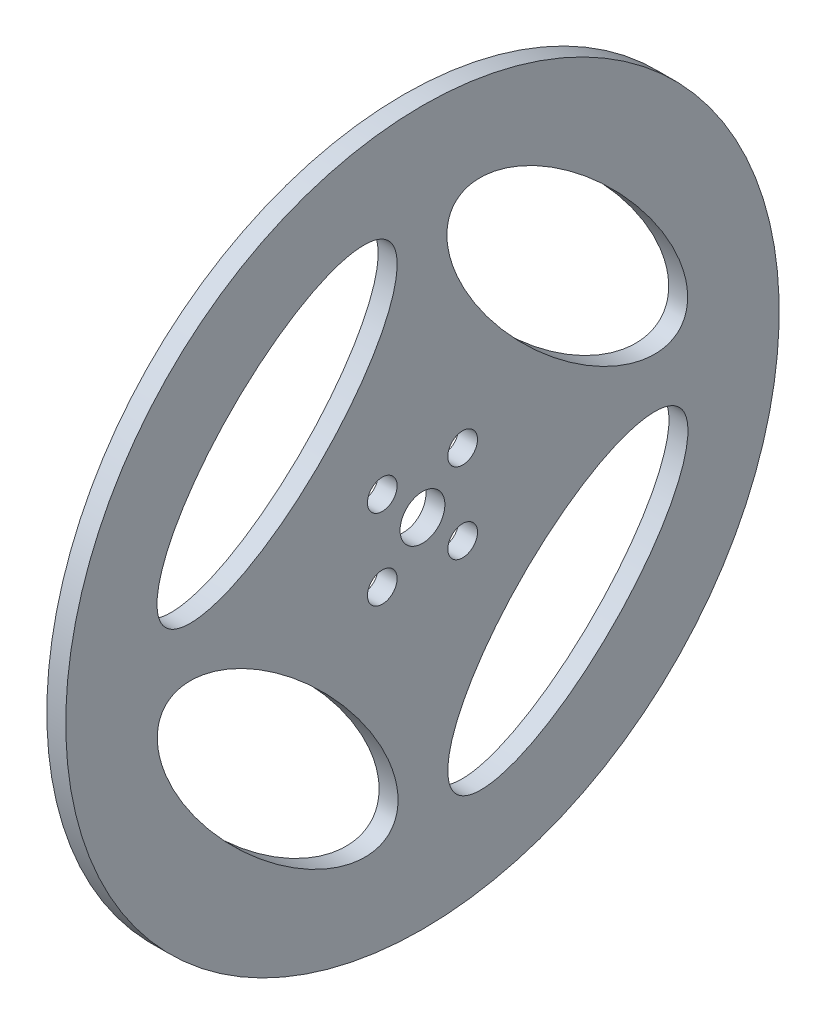
ISO-10303-21;
HEADER;
FILE_DESCRIPTION(('STEP AP214'),'2;1');
FILE_NAME('part.step','',(''),(''),'','','');
FILE_SCHEMA(('AUTOMOTIVE_DESIGN { 1 0 10303 214 1 1 1 1 }'));
ENDSEC;
DATA;
#1=APPLICATION_CONTEXT('core data for automotive mechanical design processes');
#2=APPLICATION_PROTOCOL_DEFINITION('international standard','automotive_design',2000,#1);
#3=PRODUCT_CONTEXT('',#1,'mechanical');
#4=PRODUCT('Part','Part','',(#3));
#5=PRODUCT_RELATED_PRODUCT_CATEGORY('part','',(#4));
#6=PRODUCT_DEFINITION_FORMATION('','',#4);
#7=PRODUCT_DEFINITION_CONTEXT('part definition',#1,'design');
#8=PRODUCT_DEFINITION('design','',#6,#7);
#9=PRODUCT_DEFINITION_SHAPE('','',#8);
#10=(LENGTH_UNIT() NAMED_UNIT(*) SI_UNIT(.MILLI.,.METRE.));
#11=(NAMED_UNIT(*) PLANE_ANGLE_UNIT() SI_UNIT($,.RADIAN.));
#12=(NAMED_UNIT(*) SI_UNIT($,.STERADIAN.) SOLID_ANGLE_UNIT());
#13=UNCERTAINTY_MEASURE_WITH_UNIT(LENGTH_MEASURE(1.E-05),#10,'distance_accuracy_value','');
#14=(GEOMETRIC_REPRESENTATION_CONTEXT(3) GLOBAL_UNCERTAINTY_ASSIGNED_CONTEXT((#13)) GLOBAL_UNIT_ASSIGNED_CONTEXT((#10,
#11,#12)) REPRESENTATION_CONTEXT('',''));
#15=CARTESIAN_POINT('',(0.,0.,0.));
#16=DIRECTION('',(0.,0.,1.));
#17=DIRECTION('',(1.,0.,0.));
#18=AXIS2_PLACEMENT_3D('',#15,#16,#17);
#19=CARTESIAN_POINT('',(-41.053372852788,13.3,0.));
#20=DIRECTION('',(-1.,0.,0.));
#21=DIRECTION('',(0.,-1.,0.));
#22=AXIS2_PLACEMENT_3D('',#19,#20,#21);
#23=PLANE('',#22);
#24=CARTESIAN_POINT('',(-41.053372852788,32.7773295973494,-22.9345155078859));
#25=DIRECTION('',(1.,0.,0.));
#26=DIRECTION('',(0.,-0.705987654506573,-0.708224139439138));
#27=AXIS2_PLACEMENT_3D('',#24,#25,#26);
#28=ELLIPSE('',#27,25.,10.);
#29=CARTESIAN_POINT('',(-41.053372852788,15.1276382346851,-40.6401189938644));
#30=VERTEX_POINT('',#29);
#31=EDGE_CURVE('E147',#30,#30,#28,.T.);
#32=ORIENTED_EDGE('',*,*,#31,.T.);
#33=EDGE_LOOP('',(#32));
#34=FACE_BOUND('',#33,.T.);
#35=CARTESIAN_POINT('',(-41.053372852788,-13.1845155078862,-23.0273295973492));
#36=DIRECTION('',(1.,0.,0.));
#37=DIRECTION('',(0.,-0.708224139439131,0.70598765450658));
#38=AXIS2_PLACEMENT_3D('',#35,#36,#37);
#39=ELLIPSE('',#38,25.,10.);
#40=CARTESIAN_POINT('',(-41.053372852788,-30.8901189938644,-5.37763823468465));
#41=VERTEX_POINT('',#40);
#42=EDGE_CURVE('E151',#41,#41,#39,.T.);
#43=ORIENTED_EDGE('',*,*,#42,.T.);
#44=EDGE_LOOP('',(#43));
#45=FACE_BOUND('',#44,.T.);
#46=CARTESIAN_POINT('',(-41.053372852788,-13.2773295973493,22.9345155078861));
#47=DIRECTION('',(1.,0.,0.));
#48=DIRECTION('',(0.,0.705987654506578,0.708224139439133));
#49=AXIS2_PLACEMENT_3D('',#46,#47,#48);
#50=ELLIPSE('',#49,25.,10.);
#51=CARTESIAN_POINT('',(-41.053372852788,4.37236176531519,40.6401189938644));
#52=VERTEX_POINT('',#51);
#53=EDGE_CURVE('E101',#52,#52,#50,.T.);
#54=ORIENTED_EDGE('',*,*,#53,.T.);
#55=EDGE_LOOP('',(#54));
#56=FACE_BOUND('',#55,.T.);
#57=CARTESIAN_POINT('',(-41.053372852788,32.6845155078861,23.0273295973492));
#58=DIRECTION('',(1.,0.,0.));
#59=DIRECTION('',(0.,0.708224139439131,-0.70598765450658));
#60=AXIS2_PLACEMENT_3D('',#57,#58,#59);
#61=ELLIPSE('',#60,25.,10.);
#62=CARTESIAN_POINT('',(-41.053372852788,50.3901189938644,5.37763823468466));
#63=VERTEX_POINT('',#62);
#64=EDGE_CURVE('E91',#63,#63,#61,.T.);
#65=ORIENTED_EDGE('',*,*,#64,.T.);
#66=EDGE_LOOP('',(#65));
#67=FACE_BOUND('',#66,.T.);
#68=CARTESIAN_POINT('',(-41.0533728527879,3.38603896932104,6.36396103067892));
#69=DIRECTION('',(-1.,0.,0.));
#70=DIRECTION('',(0.,0.,1.));
#71=AXIS2_PLACEMENT_3D('',#68,#69,#70);
#72=CIRCLE('',#71,2.35);
#73=CARTESIAN_POINT('',(-41.0533728527879,3.38603896932104,8.71396103067892));
#74=VERTEX_POINT('',#73);
#75=EDGE_CURVE('E87',#74,#74,#72,.T.);
#76=ORIENTED_EDGE('',*,*,#75,.F.);
#77=EDGE_LOOP('',(#76));
#78=FACE_BOUND('',#77,.T.);
#79=CARTESIAN_POINT('',(-41.0533728527879,3.38603896932109,-6.36396103067896));
#80=DIRECTION('',(-1.,0.,0.));
#81=DIRECTION('',(0.,0.,1.));
#82=AXIS2_PLACEMENT_3D('',#79,#80,#81);
#83=CIRCLE('',#82,2.35);
#84=CARTESIAN_POINT('',(-41.0533728527879,3.38603896932109,-4.01396103067896));
#85=VERTEX_POINT('',#84);
#86=EDGE_CURVE('E81',#85,#85,#83,.T.);
#87=ORIENTED_EDGE('',*,*,#86,.F.);
#88=EDGE_LOOP('',(#87));
#89=FACE_BOUND('',#88,.T.);
#90=CARTESIAN_POINT('',(-41.0533728527879,16.1139610306789,-6.36396103067896));
#91=DIRECTION('',(-1.,0.,0.));
#92=DIRECTION('',(0.,0.,1.));
#93=AXIS2_PLACEMENT_3D('',#90,#91,#92);
#94=CIRCLE('',#93,2.35);
#95=CARTESIAN_POINT('',(-41.0533728527879,16.1139610306789,-4.01396103067896));
#96=VERTEX_POINT('',#95);
#97=EDGE_CURVE('E75',#96,#96,#94,.T.);
#98=ORIENTED_EDGE('',*,*,#97,.F.);
#99=EDGE_LOOP('',(#98));
#100=FACE_BOUND('',#99,.T.);
#101=CARTESIAN_POINT('',(-41.0533728527879,16.1139610306789,6.36396103067892));
#102=DIRECTION('',(-1.,0.,0.));
#103=DIRECTION('',(0.,0.,1.));
#104=AXIS2_PLACEMENT_3D('',#101,#102,#103);
#105=CIRCLE('',#104,2.35);
#106=CARTESIAN_POINT('',(-41.0533728527879,16.1139610306789,8.71396103067892));
#107=VERTEX_POINT('',#106);
#108=EDGE_CURVE('E68',#107,#107,#105,.T.);
#109=ORIENTED_EDGE('',*,*,#108,.F.);
#110=EDGE_LOOP('',(#109));
#111=FACE_BOUND('',#110,.T.);
#112=CARTESIAN_POINT('',(-41.053372852788,9.74999999999999,0.));
#113=DIRECTION('',(1.,0.,0.));
#114=DIRECTION('',(0.,1.,0.));
#115=AXIS2_PLACEMENT_3D('',#112,#113,#114);
#116=CIRCLE('',#115,3.55);
#117=CARTESIAN_POINT('',(-41.053372852788,13.3,0.));
#118=VERTEX_POINT('',#117);
#119=EDGE_CURVE('E10',#118,#118,#116,.T.);
#120=ORIENTED_EDGE('',*,*,#119,.T.);
#121=EDGE_LOOP('',(#120));
#122=FACE_BOUND('',#121,.T.);
#123=CARTESIAN_POINT('',(-41.0533728527879,9.74999999999999,0.));
#124=DIRECTION('',(1.,0.,0.));
#125=DIRECTION('',(0.,1.,0.));
#126=AXIS2_PLACEMENT_3D('',#123,#124,#125);
#127=CIRCLE('',#126,56.5);
#128=CARTESIAN_POINT('',(-41.053372852788,66.25,0.));
#129=VERTEX_POINT('',#128);
#130=EDGE_CURVE('E59',#129,#129,#127,.T.);
#131=ORIENTED_EDGE('',*,*,#130,.F.);
#132=EDGE_LOOP('',(#131));
#133=FACE_BOUND('',#132,.T.);
#134=ADVANCED_FACE('F39',(#34,#45,#56,#67,#78,#89,#100,#111,#122,#133),#23,.T.);
#135=CARTESIAN_POINT('',(-17.6629112004517,9.75,0.));
#136=DIRECTION('',(1.,0.,0.));
#137=DIRECTION('',(0.,1.,0.));
#138=AXIS2_PLACEMENT_3D('',#135,#136,#137);
#139=CYLINDRICAL_SURFACE('',#138,3.55);
#140=CARTESIAN_POINT('',(-38.053372852788,9.74999999999999,0.));
#141=DIRECTION('',(1.,0.,0.));
#142=DIRECTION('',(0.,1.,0.));
#143=AXIS2_PLACEMENT_3D('',#140,#141,#142);
#144=CIRCLE('',#143,3.55);
#145=CARTESIAN_POINT('',(-38.053372852788,13.3,0.));
#146=VERTEX_POINT('',#145);
#147=EDGE_CURVE('E46',#146,#146,#144,.T.);
#148=ORIENTED_EDGE('',*,*,#147,.T.);
#149=EDGE_LOOP('',(#148));
#150=FACE_BOUND('',#149,.T.);
#151=ORIENTED_EDGE('',*,*,#119,.F.);
#152=EDGE_LOOP('',(#151));
#153=FACE_BOUND('',#152,.T.);
#154=ADVANCED_FACE('F134',(#150,#153),#139,.F.);
#155=CARTESIAN_POINT('',(-38.0533728527879,13.3,0.));
#156=DIRECTION('',(1.,0.,0.));
#157=DIRECTION('',(0.,1.,0.));
#158=AXIS2_PLACEMENT_3D('',#155,#156,#157);
#159=PLANE('',#158);
#160=CARTESIAN_POINT('',(-38.053372852788,32.7773295973494,-22.9345155078859));
#161=DIRECTION('',(1.,0.,0.));
#162=DIRECTION('',(0.,-0.705987654506573,-0.708224139439138));
#163=AXIS2_PLACEMENT_3D('',#160,#161,#162);
#164=ELLIPSE('',#163,25.,10.);
#165=CARTESIAN_POINT('',(-38.053372852788,15.1276382346851,-40.6401189938644));
#166=VERTEX_POINT('',#165);
#167=EDGE_CURVE('E194',#166,#166,#164,.T.);
#168=ORIENTED_EDGE('',*,*,#167,.F.);
#169=EDGE_LOOP('',(#168));
#170=FACE_BOUND('',#169,.T.);
#171=CARTESIAN_POINT('',(-38.053372852788,-13.1845155078862,-23.0273295973492));
#172=DIRECTION('',(1.,0.,0.));
#173=DIRECTION('',(0.,-0.708224139439131,0.70598765450658));
#174=AXIS2_PLACEMENT_3D('',#171,#172,#173);
#175=ELLIPSE('',#174,25.,10.);
#176=CARTESIAN_POINT('',(-38.053372852788,-30.8901189938644,-5.37763823468465));
#177=VERTEX_POINT('',#176);
#178=EDGE_CURVE('E186',#177,#177,#175,.T.);
#179=ORIENTED_EDGE('',*,*,#178,.F.);
#180=EDGE_LOOP('',(#179));
#181=FACE_BOUND('',#180,.T.);
#182=CARTESIAN_POINT('',(-38.053372852788,-13.2773295973493,22.9345155078861));
#183=DIRECTION('',(1.,0.,0.));
#184=DIRECTION('',(0.,0.705987654506578,0.708224139439133));
#185=AXIS2_PLACEMENT_3D('',#182,#183,#184);
#186=ELLIPSE('',#185,25.,10.);
#187=CARTESIAN_POINT('',(-38.053372852788,4.37236176531519,40.6401189938644));
#188=VERTEX_POINT('',#187);
#189=EDGE_CURVE('E95',#188,#188,#186,.T.);
#190=ORIENTED_EDGE('',*,*,#189,.F.);
#191=EDGE_LOOP('',(#190));
#192=FACE_BOUND('',#191,.T.);
#193=CARTESIAN_POINT('',(-38.053372852788,32.6845155078861,23.0273295973492));
#194=DIRECTION('',(1.,0.,0.));
#195=DIRECTION('',(0.,0.708224139439131,-0.70598765450658));
#196=AXIS2_PLACEMENT_3D('',#193,#194,#195);
#197=ELLIPSE('',#196,25.,10.);
#198=CARTESIAN_POINT('',(-38.053372852788,50.3901189938644,5.37763823468466));
#199=VERTEX_POINT('',#198);
#200=EDGE_CURVE('E90',#199,#199,#197,.T.);
#201=ORIENTED_EDGE('',*,*,#200,.F.);
#202=EDGE_LOOP('',(#201));
#203=FACE_BOUND('',#202,.T.);
#204=CARTESIAN_POINT('',(-38.0533728527879,3.38603896932104,6.36396103067892));
#205=DIRECTION('',(-1.,0.,0.));
#206=DIRECTION('',(0.,0.,1.));
#207=AXIS2_PLACEMENT_3D('',#204,#205,#206);
#208=CIRCLE('',#207,2.35);
#209=CARTESIAN_POINT('',(-38.0533728527879,3.38603896932104,8.71396103067892));
#210=VERTEX_POINT('',#209);
#211=EDGE_CURVE('E84',#210,#210,#208,.T.);
#212=ORIENTED_EDGE('',*,*,#211,.T.);
#213=EDGE_LOOP('',(#212));
#214=FACE_BOUND('',#213,.T.);
#215=CARTESIAN_POINT('',(-38.0533728527879,3.38603896932109,-6.36396103067896));
#216=DIRECTION('',(-1.,0.,0.));
#217=DIRECTION('',(0.,0.,1.));
#218=AXIS2_PLACEMENT_3D('',#215,#216,#217);
#219=CIRCLE('',#218,2.35);
#220=CARTESIAN_POINT('',(-38.0533728527879,3.38603896932109,-4.01396103067896));
#221=VERTEX_POINT('',#220);
#222=EDGE_CURVE('E78',#221,#221,#219,.T.);
#223=ORIENTED_EDGE('',*,*,#222,.T.);
#224=EDGE_LOOP('',(#223));
#225=FACE_BOUND('',#224,.T.);
#226=CARTESIAN_POINT('',(-38.0533728527879,16.1139610306789,-6.36396103067896));
#227=DIRECTION('',(-1.,0.,0.));
#228=DIRECTION('',(0.,0.,1.));
#229=AXIS2_PLACEMENT_3D('',#226,#227,#228);
#230=CIRCLE('',#229,2.35);
#231=CARTESIAN_POINT('',(-38.0533728527879,16.1139610306789,-4.01396103067896));
#232=VERTEX_POINT('',#231);
#233=EDGE_CURVE('E72',#232,#232,#230,.T.);
#234=ORIENTED_EDGE('',*,*,#233,.T.);
#235=EDGE_LOOP('',(#234));
#236=FACE_BOUND('',#235,.T.);
#237=CARTESIAN_POINT('',(-38.0533728527879,16.1139610306789,6.36396103067892));
#238=DIRECTION('',(-1.,0.,0.));
#239=DIRECTION('',(0.,0.,1.));
#240=AXIS2_PLACEMENT_3D('',#237,#238,#239);
#241=CIRCLE('',#240,2.35);
#242=CARTESIAN_POINT('',(-38.0533728527879,16.1139610306789,8.71396103067892));
#243=VERTEX_POINT('',#242);
#244=EDGE_CURVE('E65',#243,#243,#241,.T.);
#245=ORIENTED_EDGE('',*,*,#244,.T.);
#246=EDGE_LOOP('',(#245));
#247=FACE_BOUND('',#246,.T.);
#248=CARTESIAN_POINT('',(-38.0533728527879,9.74999999999999,0.));
#249=DIRECTION('',(1.,0.,0.));
#250=DIRECTION('',(0.,1.,0.));
#251=AXIS2_PLACEMENT_3D('',#248,#249,#250);
#252=CIRCLE('',#251,56.5);
#253=CARTESIAN_POINT('',(-38.053372852788,66.25,0.));
#254=VERTEX_POINT('',#253);
#255=EDGE_CURVE('E53',#254,#254,#252,.T.);
#256=ORIENTED_EDGE('',*,*,#255,.T.);
#257=EDGE_LOOP('',(#256));
#258=FACE_BOUND('',#257,.T.);
#259=ORIENTED_EDGE('',*,*,#147,.F.);
#260=EDGE_LOOP('',(#259));
#261=FACE_BOUND('',#260,.T.);
#262=ADVANCED_FACE('F131',(#170,#181,#192,#203,#214,#225,#236,#247,#258,#261),#159,.T.);
#263=CARTESIAN_POINT('',(-17.6629112004517,9.75,0.));
#264=DIRECTION('',(1.,0.,0.));
#265=DIRECTION('',(0.,1.,0.));
#266=AXIS2_PLACEMENT_3D('',#263,#264,#265);
#267=CYLINDRICAL_SURFACE('',#266,56.5);
#268=ORIENTED_EDGE('',*,*,#130,.T.);
#269=EDGE_LOOP('',(#268));
#270=FACE_BOUND('',#269,.T.);
#271=ORIENTED_EDGE('',*,*,#255,.F.);
#272=EDGE_LOOP('',(#271));
#273=FACE_BOUND('',#272,.T.);
#274=ADVANCED_FACE('F127',(#270,#273),#267,.T.);
#275=CARTESIAN_POINT('',(-41.0533728527879,16.1139610306789,6.36396103067892));
#276=DIRECTION('',(-1.,0.,0.));
#277=DIRECTION('',(0.,0.,1.));
#278=AXIS2_PLACEMENT_3D('',#275,#276,#277);
#279=CYLINDRICAL_SURFACE('',#278,2.35);
#280=ORIENTED_EDGE('',*,*,#244,.F.);
#281=EDGE_LOOP('',(#280));
#282=FACE_BOUND('',#281,.T.);
#283=ORIENTED_EDGE('',*,*,#108,.T.);
#284=EDGE_LOOP('',(#283));
#285=FACE_BOUND('',#284,.T.);
#286=ADVANCED_FACE('F123',(#282,#285),#279,.F.);
#287=CARTESIAN_POINT('',(-41.0533728527879,16.1139610306789,-6.36396103067896));
#288=DIRECTION('',(-1.,0.,0.));
#289=DIRECTION('',(0.,0.,1.));
#290=AXIS2_PLACEMENT_3D('',#287,#288,#289);
#291=CYLINDRICAL_SURFACE('',#290,2.35);
#292=ORIENTED_EDGE('',*,*,#233,.F.);
#293=EDGE_LOOP('',(#292));
#294=FACE_BOUND('',#293,.T.);
#295=ORIENTED_EDGE('',*,*,#97,.T.);
#296=EDGE_LOOP('',(#295));
#297=FACE_BOUND('',#296,.T.);
#298=ADVANCED_FACE('F119',(#294,#297),#291,.F.);
#299=CARTESIAN_POINT('',(-41.0533728527879,3.38603896932109,-6.36396103067896));
#300=DIRECTION('',(-1.,0.,0.));
#301=DIRECTION('',(0.,0.,1.));
#302=AXIS2_PLACEMENT_3D('',#299,#300,#301);
#303=CYLINDRICAL_SURFACE('',#302,2.35);
#304=ORIENTED_EDGE('',*,*,#222,.F.);
#305=EDGE_LOOP('',(#304));
#306=FACE_BOUND('',#305,.T.);
#307=ORIENTED_EDGE('',*,*,#86,.T.);
#308=EDGE_LOOP('',(#307));
#309=FACE_BOUND('',#308,.T.);
#310=ADVANCED_FACE('F115',(#306,#309),#303,.F.);
#311=CARTESIAN_POINT('',(-41.0533728527879,3.38603896932104,6.36396103067892));
#312=DIRECTION('',(-1.,0.,0.));
#313=DIRECTION('',(0.,0.,1.));
#314=AXIS2_PLACEMENT_3D('',#311,#312,#313);
#315=CYLINDRICAL_SURFACE('',#314,2.35);
#316=ORIENTED_EDGE('',*,*,#211,.F.);
#317=EDGE_LOOP('',(#316));
#318=FACE_BOUND('',#317,.T.);
#319=ORIENTED_EDGE('',*,*,#75,.T.);
#320=EDGE_LOOP('',(#319));
#321=FACE_BOUND('',#320,.T.);
#322=ADVANCED_FACE('F109',(#318,#321),#315,.F.);
#323=CARTESIAN_POINT('',(-41.054372852788,32.6845155078861,23.0273295973492));
#324=DIRECTION('',(1.,0.,0.));
#325=DIRECTION('',(0.,0.708224139439131,-0.70598765450658));
#326=AXIS2_PLACEMENT_3D('',#323,#324,#325);
#327=ELLIPSE('',#326,25.,10.);
#328=DIRECTION('',(1.,0.,0.));
#329=VECTOR('',#328,1.);
#330=SURFACE_OF_LINEAR_EXTRUSION('',#327,#329);
#331=ORIENTED_EDGE('',*,*,#64,.F.);
#332=EDGE_LOOP('',(#331));
#333=FACE_BOUND('',#332,.T.);
#334=ORIENTED_EDGE('',*,*,#200,.T.);
#335=EDGE_LOOP('',(#334));
#336=FACE_BOUND('',#335,.T.);
#337=ADVANCED_FACE('F104',(#333,#336),#330,.F.);
#338=CARTESIAN_POINT('',(-41.054372852788,-13.2773295973493,22.9345155078861));
#339=DIRECTION('',(1.,0.,0.));
#340=DIRECTION('',(0.,0.705987654506578,0.708224139439133));
#341=AXIS2_PLACEMENT_3D('',#338,#339,#340);
#342=ELLIPSE('',#341,25.,10.);
#343=DIRECTION('',(1.,0.,0.));
#344=VECTOR('',#343,1.);
#345=SURFACE_OF_LINEAR_EXTRUSION('',#342,#344);
#346=ORIENTED_EDGE('',*,*,#53,.F.);
#347=EDGE_LOOP('',(#346));
#348=FACE_BOUND('',#347,.T.);
#349=ORIENTED_EDGE('',*,*,#189,.T.);
#350=EDGE_LOOP('',(#349));
#351=FACE_BOUND('',#350,.T.);
#352=ADVANCED_FACE('F108',(#348,#351),#345,.F.);
#353=CARTESIAN_POINT('',(-41.054372852788,-13.1845155078862,-23.0273295973492));
#354=DIRECTION('',(1.,0.,0.));
#355=DIRECTION('',(0.,-0.708224139439131,0.70598765450658));
#356=AXIS2_PLACEMENT_3D('',#353,#354,#355);
#357=ELLIPSE('',#356,25.,10.);
#358=DIRECTION('',(1.,0.,0.));
#359=VECTOR('',#358,1.);
#360=SURFACE_OF_LINEAR_EXTRUSION('',#357,#359);
#361=ORIENTED_EDGE('',*,*,#42,.F.);
#362=EDGE_LOOP('',(#361));
#363=FACE_BOUND('',#362,.T.);
#364=ORIENTED_EDGE('',*,*,#178,.T.);
#365=EDGE_LOOP('',(#364));
#366=FACE_BOUND('',#365,.T.);
#367=ADVANCED_FACE('F201',(#363,#366),#360,.F.);
#368=CARTESIAN_POINT('',(-41.054372852788,32.7773295973494,-22.9345155078859));
#369=DIRECTION('',(1.,0.,0.));
#370=DIRECTION('',(0.,-0.705987654506573,-0.708224139439138));
#371=AXIS2_PLACEMENT_3D('',#368,#369,#370);
#372=ELLIPSE('',#371,25.,10.);
#373=DIRECTION('',(1.,0.,0.));
#374=VECTOR('',#373,1.);
#375=SURFACE_OF_LINEAR_EXTRUSION('',#372,#374);
#376=ORIENTED_EDGE('',*,*,#31,.F.);
#377=EDGE_LOOP('',(#376));
#378=FACE_BOUND('',#377,.T.);
#379=ORIENTED_EDGE('',*,*,#167,.T.);
#380=EDGE_LOOP('',(#379));
#381=FACE_BOUND('',#380,.T.);
#382=ADVANCED_FACE('F204',(#378,#381),#375,.F.);
#383=CLOSED_SHELL('',(#134,#154,#262,#274,#286,#298,#310,#322,#337,#352,#367,#382));
#384=MANIFOLD_SOLID_BREP('B2',#383);
#385=ADVANCED_BREP_SHAPE_REPRESENTATION('',(#18,#384),#14);
#386=SHAPE_DEFINITION_REPRESENTATION(#9,#385);
ENDSEC;
END-ISO-10303-21;
